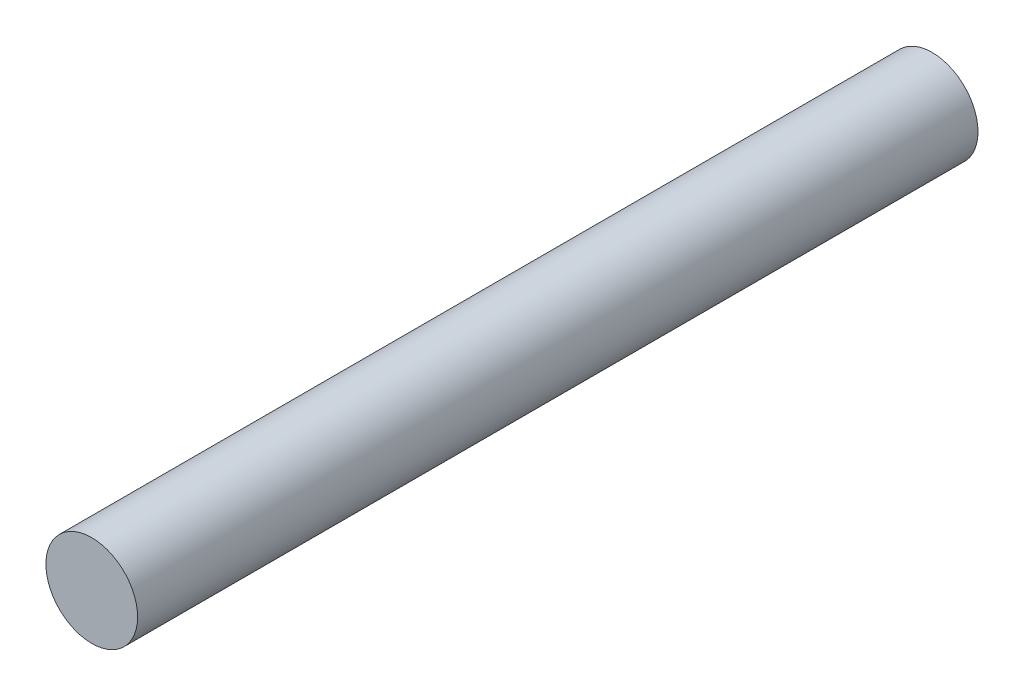
ISO-10303-21;
HEADER;
FILE_DESCRIPTION(('STEP AP214'),'2;1');
FILE_NAME('part.step','',(''),(''),'','','');
FILE_SCHEMA(('AUTOMOTIVE_DESIGN { 1 0 10303 214 1 1 1 1 }'));
ENDSEC;
DATA;
#1=APPLICATION_CONTEXT('core data for automotive mechanical design processes');
#2=APPLICATION_PROTOCOL_DEFINITION('international standard','automotive_design',2000,#1);
#3=PRODUCT_CONTEXT('',#1,'mechanical');
#4=PRODUCT('Part','Part','',(#3));
#5=PRODUCT_RELATED_PRODUCT_CATEGORY('part','',(#4));
#6=PRODUCT_DEFINITION_FORMATION('','',#4);
#7=PRODUCT_DEFINITION_CONTEXT('part definition',#1,'design');
#8=PRODUCT_DEFINITION('design','',#6,#7);
#9=PRODUCT_DEFINITION_SHAPE('','',#8);
#10=(LENGTH_UNIT() NAMED_UNIT(*) SI_UNIT(.MILLI.,.METRE.));
#11=(NAMED_UNIT(*) PLANE_ANGLE_UNIT() SI_UNIT($,.RADIAN.));
#12=(NAMED_UNIT(*) SI_UNIT($,.STERADIAN.) SOLID_ANGLE_UNIT());
#13=UNCERTAINTY_MEASURE_WITH_UNIT(LENGTH_MEASURE(1.E-05),#10,'distance_accuracy_value','');
#14=(GEOMETRIC_REPRESENTATION_CONTEXT(3) GLOBAL_UNCERTAINTY_ASSIGNED_CONTEXT((#13)) GLOBAL_UNIT_ASSIGNED_CONTEXT((#10,
#11,#12)) REPRESENTATION_CONTEXT('',''));
#15=CARTESIAN_POINT('',(0.,0.,0.));
#16=DIRECTION('',(0.,0.,1.));
#17=DIRECTION('',(1.,0.,0.));
#18=AXIS2_PLACEMENT_3D('',#15,#16,#17);
#19=CARTESIAN_POINT('',(0.,0.,55.));
#20=DIRECTION('',(0.,0.,-1.));
#21=DIRECTION('',(-1.,0.,0.));
#22=AXIS2_PLACEMENT_3D('',#19,#20,#21);
#23=CYLINDRICAL_SURFACE('',#22,3.);
#24=CARTESIAN_POINT('',(0.,0.,55.));
#25=DIRECTION('',(0.,0.,1.));
#26=DIRECTION('',(1.,0.,0.));
#27=AXIS2_PLACEMENT_3D('',#24,#25,#26);
#28=CIRCLE('',#27,3.);
#29=CARTESIAN_POINT('',(3.,0.,55.));
#30=VERTEX_POINT('',#29);
#31=EDGE_CURVE('E10',#30,#30,#28,.T.);
#32=ORIENTED_EDGE('',*,*,#31,.F.);
#33=EDGE_LOOP('',(#32));
#34=FACE_BOUND('',#33,.T.);
#35=CARTESIAN_POINT('',(0.,0.,0.));
#36=DIRECTION('',(0.,0.,1.));
#37=DIRECTION('',(1.,0.,0.));
#38=AXIS2_PLACEMENT_3D('',#35,#36,#37);
#39=CIRCLE('',#38,3.);
#40=CARTESIAN_POINT('',(3.,0.,0.));
#41=VERTEX_POINT('',#40);
#42=EDGE_CURVE('E34',#41,#41,#39,.T.);
#43=ORIENTED_EDGE('',*,*,#42,.T.);
#44=EDGE_LOOP('',(#43));
#45=FACE_BOUND('',#44,.T.);
#46=ADVANCED_FACE('F31',(#34,#45),#23,.T.);
#47=CARTESIAN_POINT('',(0.,0.,55.));
#48=DIRECTION('',(0.,0.,1.));
#49=DIRECTION('',(1.,0.,0.));
#50=AXIS2_PLACEMENT_3D('',#47,#48,#49);
#51=PLANE('',#50);
#52=ORIENTED_EDGE('',*,*,#31,.T.);
#53=EDGE_LOOP('',(#52));
#54=FACE_BOUND('',#53,.T.);
#55=ADVANCED_FACE('F46',(#54),#51,.T.);
#56=CARTESIAN_POINT('',(0.,0.,0.));
#57=DIRECTION('',(0.,0.,1.));
#58=DIRECTION('',(1.,0.,0.));
#59=AXIS2_PLACEMENT_3D('',#56,#57,#58);
#60=PLANE('',#59);
#61=ORIENTED_EDGE('',*,*,#42,.F.);
#62=EDGE_LOOP('',(#61));
#63=FACE_BOUND('',#62,.T.);
#64=ADVANCED_FACE('F44',(#63),#60,.F.);
#65=CLOSED_SHELL('',(#46,#55,#64));
#66=MANIFOLD_SOLID_BREP('B2',#65);
#67=ADVANCED_BREP_SHAPE_REPRESENTATION('',(#18,#66),#14);
#68=SHAPE_DEFINITION_REPRESENTATION(#9,#67);
ENDSEC;
END-ISO-10303-21;
